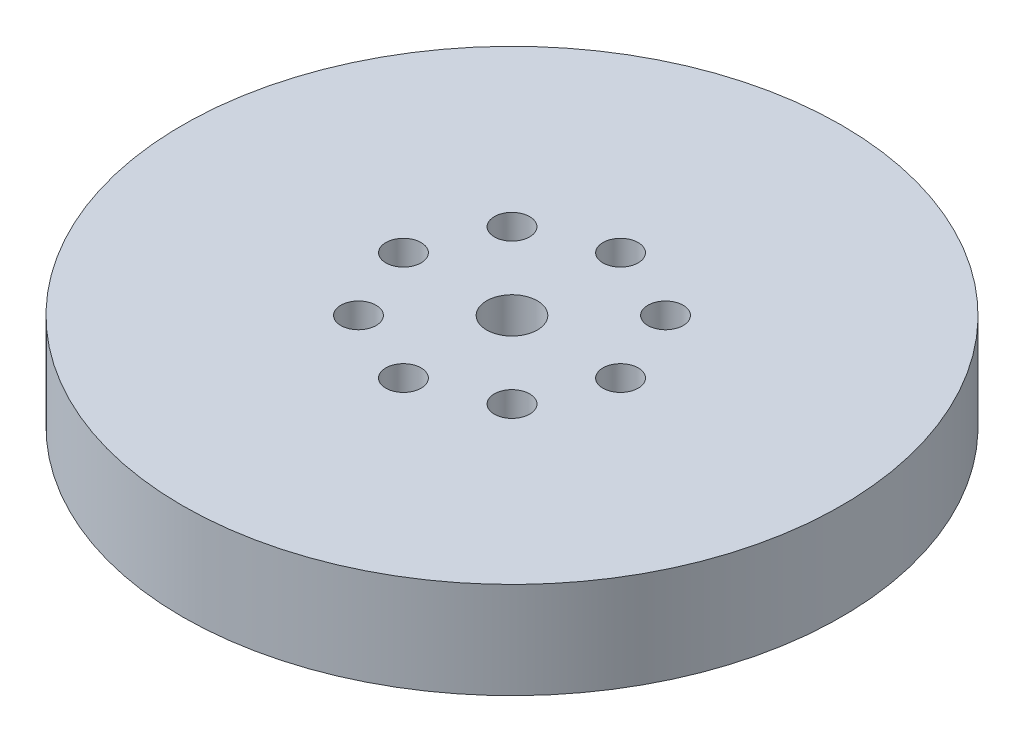
ISO-10303-21;
HEADER;
FILE_DESCRIPTION(('STEP AP214'),'2;1');
FILE_NAME('part.step','',(''),(''),'','','');
FILE_SCHEMA(('AUTOMOTIVE_DESIGN { 1 0 10303 214 1 1 1 1 }'));
ENDSEC;
DATA;
#1=APPLICATION_CONTEXT('core data for automotive mechanical design processes');
#2=APPLICATION_PROTOCOL_DEFINITION('international standard','automotive_design',2000,#1);
#3=PRODUCT_CONTEXT('',#1,'mechanical');
#4=PRODUCT('Part','Part','',(#3));
#5=PRODUCT_RELATED_PRODUCT_CATEGORY('part','',(#4));
#6=PRODUCT_DEFINITION_FORMATION('','',#4);
#7=PRODUCT_DEFINITION_CONTEXT('part definition',#1,'design');
#8=PRODUCT_DEFINITION('design','',#6,#7);
#9=PRODUCT_DEFINITION_SHAPE('','',#8);
#10=(LENGTH_UNIT() NAMED_UNIT(*) SI_UNIT(.MILLI.,.METRE.));
#11=(NAMED_UNIT(*) PLANE_ANGLE_UNIT() SI_UNIT($,.RADIAN.));
#12=(NAMED_UNIT(*) SI_UNIT($,.STERADIAN.) SOLID_ANGLE_UNIT());
#13=UNCERTAINTY_MEASURE_WITH_UNIT(LENGTH_MEASURE(1.E-05),#10,'distance_accuracy_value','');
#14=(GEOMETRIC_REPRESENTATION_CONTEXT(3) GLOBAL_UNCERTAINTY_ASSIGNED_CONTEXT((#13)) GLOBAL_UNIT_ASSIGNED_CONTEXT((#10,
#11,#12)) REPRESENTATION_CONTEXT('',''));
#15=CARTESIAN_POINT('',(0.,0.,0.));
#16=DIRECTION('',(0.,0.,1.));
#17=DIRECTION('',(1.,0.,0.));
#18=AXIS2_PLACEMENT_3D('',#15,#16,#17);
#19=CARTESIAN_POINT('',(0.,19.,0.));
#20=DIRECTION('',(0.,-1.,0.));
#21=DIRECTION('',(0.,0.,-1.));
#22=AXIS2_PLACEMENT_3D('',#19,#20,#21);
#23=CYLINDRICAL_SURFACE('',#22,65.);
#24=CARTESIAN_POINT('',(0.,19.,0.));
#25=DIRECTION('',(0.,1.,0.));
#26=DIRECTION('',(0.,0.,1.));
#27=AXIS2_PLACEMENT_3D('',#24,#25,#26);
#28=CIRCLE('',#27,65.);
#29=CARTESIAN_POINT('',(0.,19.,65.));
#30=VERTEX_POINT('',#29);
#31=EDGE_CURVE('E10',#30,#30,#28,.T.);
#32=ORIENTED_EDGE('',*,*,#31,.F.);
#33=EDGE_LOOP('',(#32));
#34=FACE_BOUND('',#33,.T.);
#35=CARTESIAN_POINT('',(0.,0.,0.));
#36=DIRECTION('',(0.,1.,0.));
#37=DIRECTION('',(0.,0.,1.));
#38=AXIS2_PLACEMENT_3D('',#35,#36,#37);
#39=CIRCLE('',#38,65.);
#40=CARTESIAN_POINT('',(0.,0.,65.));
#41=VERTEX_POINT('',#40);
#42=EDGE_CURVE('E37',#41,#41,#39,.T.);
#43=ORIENTED_EDGE('',*,*,#42,.T.);
#44=EDGE_LOOP('',(#43));
#45=FACE_BOUND('',#44,.T.);
#46=ADVANCED_FACE('F40',(#34,#45),#23,.T.);
#47=CARTESIAN_POINT('',(0.,19.,0.));
#48=DIRECTION('',(0.,1.,0.));
#49=DIRECTION('',(0.,0.,1.));
#50=AXIS2_PLACEMENT_3D('',#47,#48,#49);
#51=PLANE('',#50);
#52=CARTESIAN_POINT('',(0.,19.,21.4099349804049));
#53=DIRECTION('',(0.,1.,0.));
#54=DIRECTION('',(1.,0.,0.));
#55=AXIS2_PLACEMENT_3D('',#52,#53,#54);
#56=CIRCLE('',#55,3.47957380553751);
#57=CARTESIAN_POINT('',(3.47957380553759,19.,21.4099349804049));
#58=VERTEX_POINT('',#57);
#59=EDGE_CURVE('E88',#58,#58,#56,.T.);
#60=ORIENTED_EDGE('',*,*,#59,.F.);
#61=EDGE_LOOP('',(#60));
#62=FACE_BOUND('',#61,.T.);
#63=CARTESIAN_POINT('',(15.1391102094074,19.,15.1391102094073));
#64=DIRECTION('',(0.,1.,0.));
#65=DIRECTION('',(0.707106781186544,0.,-0.707106781186551));
#66=AXIS2_PLACEMENT_3D('',#63,#64,#65);
#67=CIRCLE('',#66,3.47957380553751);
#68=CARTESIAN_POINT('',(17.5995404429421,19.,12.6786799758726));
#69=VERTEX_POINT('',#68);
#70=EDGE_CURVE('E79',#69,#69,#67,.T.);
#71=ORIENTED_EDGE('',*,*,#70,.F.);
#72=EDGE_LOOP('',(#71));
#73=FACE_BOUND('',#72,.T.);
#74=CARTESIAN_POINT('',(21.4099349804049,19.,0.));
#75=DIRECTION('',(0.,1.,0.));
#76=DIRECTION('',(0.,0.,-1.));
#77=AXIS2_PLACEMENT_3D('',#74,#75,#76);
#78=CIRCLE('',#77,3.47957380553751);
#79=CARTESIAN_POINT('',(21.4099349804049,19.,-3.47957380553751));
#80=VERTEX_POINT('',#79);
#81=EDGE_CURVE('E74',#80,#80,#78,.T.);
#82=ORIENTED_EDGE('',*,*,#81,.F.);
#83=EDGE_LOOP('',(#82));
#84=FACE_BOUND('',#83,.T.);
#85=CARTESIAN_POINT('',(15.1391102094072,19.,-15.1391102094075));
#86=DIRECTION('',(0.,1.,0.));
#87=DIRECTION('',(-0.707106781186554,0.,-0.707106781186541));
#88=AXIS2_PLACEMENT_3D('',#85,#86,#87);
#89=CIRCLE('',#88,3.47957380553751);
#90=CARTESIAN_POINT('',(12.6786799758726,19.,-17.5995404429421));
#91=VERTEX_POINT('',#90);
#92=EDGE_CURVE('E70',#91,#91,#89,.T.);
#93=ORIENTED_EDGE('',*,*,#92,.F.);
#94=EDGE_LOOP('',(#93));
#95=FACE_BOUND('',#94,.T.);
#96=CARTESIAN_POINT('',(-2.24257165349785E-13,19.,-21.4099349804049));
#97=DIRECTION('',(0.,1.,0.));
#98=DIRECTION('',(-1.,0.,0.));
#99=AXIS2_PLACEMENT_3D('',#96,#97,#98);
#100=CIRCLE('',#99,3.47957380553751);
#101=CARTESIAN_POINT('',(-3.47957380553774,19.,-21.4099349804048));
#102=VERTEX_POINT('',#101);
#103=EDGE_CURVE('E100',#102,#102,#100,.T.);
#104=ORIENTED_EDGE('',*,*,#103,.F.);
#105=EDGE_LOOP('',(#104));
#106=FACE_BOUND('',#105,.T.);
#107=CARTESIAN_POINT('',(-15.1391102094075,19.,-15.1391102094072));
#108=DIRECTION('',(0.,1.,0.));
#109=DIRECTION('',(-0.707106781186539,0.,0.707106781186556));
#110=AXIS2_PLACEMENT_3D('',#107,#108,#109);
#111=CIRCLE('',#110,3.47957380553751);
#112=CARTESIAN_POINT('',(-17.5995404429422,19.,-12.6786799758725));
#113=VERTEX_POINT('',#112);
#114=EDGE_CURVE('E93',#113,#113,#111,.T.);
#115=ORIENTED_EDGE('',*,*,#114,.F.);
#116=EDGE_LOOP('',(#115));
#117=FACE_BOUND('',#116,.T.);
#118=CARTESIAN_POINT('',(-15.1391102094073,19.,15.1391102094074));
#119=DIRECTION('',(0.,1.,0.));
#120=DIRECTION('',(0.707106781186549,0.,0.707106781186546));
#121=AXIS2_PLACEMENT_3D('',#118,#119,#120);
#122=CIRCLE('',#121,3.47957380553751);
#123=CARTESIAN_POINT('',(-12.6786799758727,19.,17.599540442942));
#124=VERTEX_POINT('',#123);
#125=EDGE_CURVE('E61',#124,#124,#122,.T.);
#126=ORIENTED_EDGE('',*,*,#125,.F.);
#127=EDGE_LOOP('',(#126));
#128=FACE_BOUND('',#127,.T.);
#129=CARTESIAN_POINT('',(-21.4099349804049,19.,0.));
#130=DIRECTION('',(0.,1.,0.));
#131=DIRECTION('',(0.,0.,1.));
#132=AXIS2_PLACEMENT_3D('',#129,#130,#131);
#133=CIRCLE('',#132,3.47957380553751);
#134=CARTESIAN_POINT('',(-21.4099349804049,19.,3.47957380553751));
#135=VERTEX_POINT('',#134);
#136=EDGE_CURVE('E54',#135,#135,#133,.T.);
#137=ORIENTED_EDGE('',*,*,#136,.F.);
#138=EDGE_LOOP('',(#137));
#139=FACE_BOUND('',#138,.T.);
#140=CARTESIAN_POINT('',(0.,19.,0.));
#141=DIRECTION('',(0.,1.,0.));
#142=DIRECTION('',(0.,0.,1.));
#143=AXIS2_PLACEMENT_3D('',#140,#141,#142);
#144=CIRCLE('',#143,5.);
#145=CARTESIAN_POINT('',(0.,19.,5.));
#146=VERTEX_POINT('',#145);
#147=EDGE_CURVE('E50',#146,#146,#144,.T.);
#148=ORIENTED_EDGE('',*,*,#147,.F.);
#149=EDGE_LOOP('',(#148));
#150=FACE_BOUND('',#149,.T.);
#151=ORIENTED_EDGE('',*,*,#31,.T.);
#152=EDGE_LOOP('',(#151));
#153=FACE_BOUND('',#152,.T.);
#154=ADVANCED_FACE('F115',(#62,#73,#84,#95,#106,#117,#128,#139,#150,#153),#51,.T.);
#155=CARTESIAN_POINT('',(0.,0.,0.));
#156=DIRECTION('',(0.,1.,0.));
#157=DIRECTION('',(0.,0.,1.));
#158=AXIS2_PLACEMENT_3D('',#155,#156,#157);
#159=PLANE('',#158);
#160=CARTESIAN_POINT('',(0.,0.,0.));
#161=DIRECTION('',(0.,1.,0.));
#162=DIRECTION('',(0.,0.,1.));
#163=AXIS2_PLACEMENT_3D('',#160,#161,#162);
#164=CIRCLE('',#163,5.);
#165=CARTESIAN_POINT('',(0.,0.,5.));
#166=VERTEX_POINT('',#165);
#167=EDGE_CURVE('E47',#166,#166,#164,.T.);
#168=ORIENTED_EDGE('',*,*,#167,.T.);
#169=EDGE_LOOP('',(#168));
#170=FACE_BOUND('',#169,.T.);
#171=ORIENTED_EDGE('',*,*,#42,.F.);
#172=EDGE_LOOP('',(#171));
#173=FACE_BOUND('',#172,.T.);
#174=ADVANCED_FACE('F113',(#170,#173),#159,.F.);
#175=CARTESIAN_POINT('',(0.,19.,0.));
#176=DIRECTION('',(0.,-1.,0.));
#177=DIRECTION('',(0.,0.,-1.));
#178=AXIS2_PLACEMENT_3D('',#175,#176,#177);
#179=CYLINDRICAL_SURFACE('',#178,5.);
#180=ORIENTED_EDGE('',*,*,#147,.T.);
#181=EDGE_LOOP('',(#180));
#182=FACE_BOUND('',#181,.T.);
#183=ORIENTED_EDGE('',*,*,#167,.F.);
#184=EDGE_LOOP('',(#183));
#185=FACE_BOUND('',#184,.T.);
#186=ADVANCED_FACE('F127',(#182,#185),#179,.F.);
#187=CARTESIAN_POINT('',(-21.4099349804049,7.24904921276007,0.));
#188=DIRECTION('',(0.,1.,0.));
#189=DIRECTION('',(0.,0.,1.));
#190=AXIS2_PLACEMENT_3D('',#187,#188,#189);
#191=CYLINDRICAL_SURFACE('',#190,3.47957380553751);
#192=CARTESIAN_POINT('',(-21.4099349804049,7.24904921276007,0.));
#193=DIRECTION('',(0.,1.,0.));
#194=DIRECTION('',(0.,0.,1.));
#195=AXIS2_PLACEMENT_3D('',#192,#193,#194);
#196=CIRCLE('',#195,3.47957380553751);
#197=CARTESIAN_POINT('',(-21.4099349804049,7.24904921276007,3.47957380553751));
#198=VERTEX_POINT('',#197);
#199=EDGE_CURVE('E55',#198,#198,#196,.T.);
#200=ORIENTED_EDGE('',*,*,#199,.F.);
#201=EDGE_LOOP('',(#200));
#202=FACE_BOUND('',#201,.T.);
#203=ORIENTED_EDGE('',*,*,#136,.T.);
#204=EDGE_LOOP('',(#203));
#205=FACE_BOUND('',#204,.T.);
#206=ADVANCED_FACE('F129',(#202,#205),#191,.F.);
#207=CARTESIAN_POINT('',(-21.4099349804049,7.24904921276007,0.));
#208=DIRECTION('',(0.,1.,0.));
#209=DIRECTION('',(0.,0.,1.));
#210=AXIS2_PLACEMENT_3D('',#207,#208,#209);
#211=PLANE('',#210);
#212=ORIENTED_EDGE('',*,*,#199,.T.);
#213=EDGE_LOOP('',(#212));
#214=FACE_BOUND('',#213,.T.);
#215=ADVANCED_FACE('F157',(#214),#211,.T.);
#216=CARTESIAN_POINT('',(-15.1391102094073,7.24904921276007,15.1391102094074));
#217=DIRECTION('',(0.,1.,0.));
#218=DIRECTION('',(0.,0.,1.));
#219=AXIS2_PLACEMENT_3D('',#216,#217,#218);
#220=CYLINDRICAL_SURFACE('',#219,3.47957380553751);
#221=CARTESIAN_POINT('',(-15.1391102094073,7.24904921276007,15.1391102094074));
#222=DIRECTION('',(0.,1.,0.));
#223=DIRECTION('',(0.707106781186549,0.,0.707106781186546));
#224=AXIS2_PLACEMENT_3D('',#221,#222,#223);
#225=CIRCLE('',#224,3.47957380553751);
#226=CARTESIAN_POINT('',(-12.6786799758727,7.24904921276007,17.599540442942));
#227=VERTEX_POINT('',#226);
#228=EDGE_CURVE('E59',#227,#227,#225,.T.);
#229=ORIENTED_EDGE('',*,*,#228,.F.);
#230=EDGE_LOOP('',(#229));
#231=FACE_BOUND('',#230,.T.);
#232=ORIENTED_EDGE('',*,*,#125,.T.);
#233=EDGE_LOOP('',(#232));
#234=FACE_BOUND('',#233,.T.);
#235=ADVANCED_FACE('F170',(#231,#234),#220,.F.);
#236=CARTESIAN_POINT('',(-15.1391102094073,7.24904921276007,15.1391102094074));
#237=DIRECTION('',(0.,1.,0.));
#238=DIRECTION('',(0.707106781186549,0.,0.707106781186546));
#239=AXIS2_PLACEMENT_3D('',#236,#237,#238);
#240=PLANE('',#239);
#241=ORIENTED_EDGE('',*,*,#228,.T.);
#242=EDGE_LOOP('',(#241));
#243=FACE_BOUND('',#242,.T.);
#244=ADVANCED_FACE('F182',(#243),#240,.T.);
#245=CARTESIAN_POINT('',(-15.1391102094075,7.24904921276007,-15.1391102094072));
#246=DIRECTION('',(0.,1.,0.));
#247=DIRECTION('',(0.,0.,1.));
#248=AXIS2_PLACEMENT_3D('',#245,#246,#247);
#249=CYLINDRICAL_SURFACE('',#248,3.47957380553751);
#250=CARTESIAN_POINT('',(-15.1391102094075,7.24904921276007,-15.1391102094072));
#251=DIRECTION('',(0.,1.,0.));
#252=DIRECTION('',(-0.707106781186539,0.,0.707106781186556));
#253=AXIS2_PLACEMENT_3D('',#250,#251,#252);
#254=CIRCLE('',#253,3.47957380553751);
#255=CARTESIAN_POINT('',(-17.5995404429422,7.24904921276007,-12.6786799758725));
#256=VERTEX_POINT('',#255);
#257=EDGE_CURVE('E94',#256,#256,#254,.T.);
#258=ORIENTED_EDGE('',*,*,#257,.F.);
#259=EDGE_LOOP('',(#258));
#260=FACE_BOUND('',#259,.T.);
#261=ORIENTED_EDGE('',*,*,#114,.T.);
#262=EDGE_LOOP('',(#261));
#263=FACE_BOUND('',#262,.T.);
#264=ADVANCED_FACE('F189',(#260,#263),#249,.F.);
#265=CARTESIAN_POINT('',(-15.1391102094075,7.24904921276007,-15.1391102094072));
#266=DIRECTION('',(0.,1.,0.));
#267=DIRECTION('',(-0.707106781186539,0.,0.707106781186556));
#268=AXIS2_PLACEMENT_3D('',#265,#266,#267);
#269=PLANE('',#268);
#270=ORIENTED_EDGE('',*,*,#257,.T.);
#271=EDGE_LOOP('',(#270));
#272=FACE_BOUND('',#271,.T.);
#273=ADVANCED_FACE('F107',(#272),#269,.T.);
#274=CARTESIAN_POINT('',(-2.24257165349785E-13,7.24904921276007,-21.4099349804049));
#275=DIRECTION('',(0.,1.,0.));
#276=DIRECTION('',(0.,0.,1.));
#277=AXIS2_PLACEMENT_3D('',#274,#275,#276);
#278=CYLINDRICAL_SURFACE('',#277,3.47957380553751);
#279=CARTESIAN_POINT('',(-2.24257165349785E-13,7.24904921276007,-21.4099349804049));
#280=DIRECTION('',(0.,1.,0.));
#281=DIRECTION('',(-1.,0.,0.));
#282=AXIS2_PLACEMENT_3D('',#279,#280,#281);
#283=CIRCLE('',#282,3.47957380553751);
#284=CARTESIAN_POINT('',(-3.47957380553774,7.24904921276007,-21.4099349804048));
#285=VERTEX_POINT('',#284);
#286=EDGE_CURVE('E72',#285,#285,#283,.T.);
#287=ORIENTED_EDGE('',*,*,#286,.F.);
#288=EDGE_LOOP('',(#287));
#289=FACE_BOUND('',#288,.T.);
#290=ORIENTED_EDGE('',*,*,#103,.T.);
#291=EDGE_LOOP('',(#290));
#292=FACE_BOUND('',#291,.T.);
#293=ADVANCED_FACE('F104',(#289,#292),#278,.F.);
#294=CARTESIAN_POINT('',(-2.24257165349785E-13,7.24904921276007,-21.4099349804049));
#295=DIRECTION('',(0.,1.,0.));
#296=DIRECTION('',(-1.,0.,0.));
#297=AXIS2_PLACEMENT_3D('',#294,#295,#296);
#298=PLANE('',#297);
#299=ORIENTED_EDGE('',*,*,#286,.T.);
#300=EDGE_LOOP('',(#299));
#301=FACE_BOUND('',#300,.T.);
#302=ADVANCED_FACE('F103',(#301),#298,.T.);
#303=CARTESIAN_POINT('',(15.1391102094072,7.24904921276007,-15.1391102094075));
#304=DIRECTION('',(0.,1.,0.));
#305=DIRECTION('',(0.,0.,1.));
#306=AXIS2_PLACEMENT_3D('',#303,#304,#305);
#307=CYLINDRICAL_SURFACE('',#306,3.47957380553751);
#308=CARTESIAN_POINT('',(15.1391102094072,7.24904921276007,-15.1391102094075));
#309=DIRECTION('',(0.,1.,0.));
#310=DIRECTION('',(-0.707106781186554,0.,-0.707106781186541));
#311=AXIS2_PLACEMENT_3D('',#308,#309,#310);
#312=CIRCLE('',#311,3.47957380553751);
#313=CARTESIAN_POINT('',(12.6786799758726,7.24904921276007,-17.5995404429421));
#314=VERTEX_POINT('',#313);
#315=EDGE_CURVE('E69',#314,#314,#312,.T.);
#316=ORIENTED_EDGE('',*,*,#315,.F.);
#317=EDGE_LOOP('',(#316));
#318=FACE_BOUND('',#317,.T.);
#319=ORIENTED_EDGE('',*,*,#92,.T.);
#320=EDGE_LOOP('',(#319));
#321=FACE_BOUND('',#320,.T.);
#322=ADVANCED_FACE('F219',(#318,#321),#307,.F.);
#323=CARTESIAN_POINT('',(15.1391102094072,7.24904921276007,-15.1391102094075));
#324=DIRECTION('',(0.,1.,0.));
#325=DIRECTION('',(-0.707106781186554,0.,-0.707106781186541));
#326=AXIS2_PLACEMENT_3D('',#323,#324,#325);
#327=PLANE('',#326);
#328=ORIENTED_EDGE('',*,*,#315,.T.);
#329=EDGE_LOOP('',(#328));
#330=FACE_BOUND('',#329,.T.);
#331=ADVANCED_FACE('F227',(#330),#327,.T.);
#332=CARTESIAN_POINT('',(21.4099349804049,7.24904921276007,0.));
#333=DIRECTION('',(0.,1.,0.));
#334=DIRECTION('',(0.,0.,1.));
#335=AXIS2_PLACEMENT_3D('',#332,#333,#334);
#336=CYLINDRICAL_SURFACE('',#335,3.47957380553751);
#337=CARTESIAN_POINT('',(21.4099349804049,7.24904921276007,0.));
#338=DIRECTION('',(0.,1.,0.));
#339=DIRECTION('',(0.,0.,-1.));
#340=AXIS2_PLACEMENT_3D('',#337,#338,#339);
#341=CIRCLE('',#340,3.47957380553751);
#342=CARTESIAN_POINT('',(21.4099349804049,7.24904921276007,-3.47957380553751));
#343=VERTEX_POINT('',#342);
#344=EDGE_CURVE('E80',#343,#343,#341,.T.);
#345=ORIENTED_EDGE('',*,*,#344,.F.);
#346=EDGE_LOOP('',(#345));
#347=FACE_BOUND('',#346,.T.);
#348=ORIENTED_EDGE('',*,*,#81,.T.);
#349=EDGE_LOOP('',(#348));
#350=FACE_BOUND('',#349,.T.);
#351=ADVANCED_FACE('F240',(#347,#350),#336,.F.);
#352=CARTESIAN_POINT('',(21.4099349804049,7.24904921276007,0.));
#353=DIRECTION('',(0.,1.,0.));
#354=DIRECTION('',(0.,0.,-1.));
#355=AXIS2_PLACEMENT_3D('',#352,#353,#354);
#356=PLANE('',#355);
#357=ORIENTED_EDGE('',*,*,#344,.T.);
#358=EDGE_LOOP('',(#357));
#359=FACE_BOUND('',#358,.T.);
#360=ADVANCED_FACE('F246',(#359),#356,.T.);
#361=CARTESIAN_POINT('',(15.1391102094074,7.24904921276007,15.1391102094073));
#362=DIRECTION('',(0.,1.,0.));
#363=DIRECTION('',(0.,0.,1.));
#364=AXIS2_PLACEMENT_3D('',#361,#362,#363);
#365=CYLINDRICAL_SURFACE('',#364,3.47957380553751);
#366=CARTESIAN_POINT('',(15.1391102094074,7.24904921276007,15.1391102094073));
#367=DIRECTION('',(0.,1.,0.));
#368=DIRECTION('',(0.707106781186544,0.,-0.707106781186551));
#369=AXIS2_PLACEMENT_3D('',#366,#367,#368);
#370=CIRCLE('',#369,3.47957380553751);
#371=CARTESIAN_POINT('',(17.5995404429421,7.24904921276007,12.6786799758726));
#372=VERTEX_POINT('',#371);
#373=EDGE_CURVE('E82',#372,#372,#370,.T.);
#374=ORIENTED_EDGE('',*,*,#373,.F.);
#375=EDGE_LOOP('',(#374));
#376=FACE_BOUND('',#375,.T.);
#377=ORIENTED_EDGE('',*,*,#70,.T.);
#378=EDGE_LOOP('',(#377));
#379=FACE_BOUND('',#378,.T.);
#380=ADVANCED_FACE('F254',(#376,#379),#365,.F.);
#381=CARTESIAN_POINT('',(15.1391102094074,7.24904921276007,15.1391102094073));
#382=DIRECTION('',(0.,1.,0.));
#383=DIRECTION('',(0.707106781186544,0.,-0.707106781186551));
#384=AXIS2_PLACEMENT_3D('',#381,#382,#383);
#385=PLANE('',#384);
#386=ORIENTED_EDGE('',*,*,#373,.T.);
#387=EDGE_LOOP('',(#386));
#388=FACE_BOUND('',#387,.T.);
#389=ADVANCED_FACE('F262',(#388),#385,.T.);
#390=CARTESIAN_POINT('',(0.,7.24904921276007,21.4099349804049));
#391=DIRECTION('',(0.,1.,0.));
#392=DIRECTION('',(0.,0.,1.));
#393=AXIS2_PLACEMENT_3D('',#390,#391,#392);
#394=CYLINDRICAL_SURFACE('',#393,3.47957380553751);
#395=CARTESIAN_POINT('',(0.,7.24904921276007,21.4099349804049));
#396=DIRECTION('',(0.,1.,0.));
#397=DIRECTION('',(1.,0.,0.));
#398=AXIS2_PLACEMENT_3D('',#395,#396,#397);
#399=CIRCLE('',#398,3.47957380553751);
#400=CARTESIAN_POINT('',(3.47957380553759,7.24904921276007,21.4099349804049));
#401=VERTEX_POINT('',#400);
#402=EDGE_CURVE('E63',#401,#401,#399,.T.);
#403=ORIENTED_EDGE('',*,*,#402,.F.);
#404=EDGE_LOOP('',(#403));
#405=FACE_BOUND('',#404,.T.);
#406=ORIENTED_EDGE('',*,*,#59,.T.);
#407=EDGE_LOOP('',(#406));
#408=FACE_BOUND('',#407,.T.);
#409=ADVANCED_FACE('F272',(#405,#408),#394,.F.);
#410=CARTESIAN_POINT('',(0.,7.24904921276007,21.4099349804049));
#411=DIRECTION('',(0.,1.,0.));
#412=DIRECTION('',(1.,0.,0.));
#413=AXIS2_PLACEMENT_3D('',#410,#411,#412);
#414=PLANE('',#413);
#415=ORIENTED_EDGE('',*,*,#402,.T.);
#416=EDGE_LOOP('',(#415));
#417=FACE_BOUND('',#416,.T.);
#418=ADVANCED_FACE('F285',(#417),#414,.T.);
#419=CLOSED_SHELL('',(#46,#154,#174,#186,#206,#215,#235,#244,#264,#273,#293,#302,#322,#331,#351,
#360,#380,#389,#409,#418));
#420=MANIFOLD_SOLID_BREP('B2',#419);
#421=ADVANCED_BREP_SHAPE_REPRESENTATION('',(#18,#420),#14);
#422=SHAPE_DEFINITION_REPRESENTATION(#9,#421);
ENDSEC;
END-ISO-10303-21;
